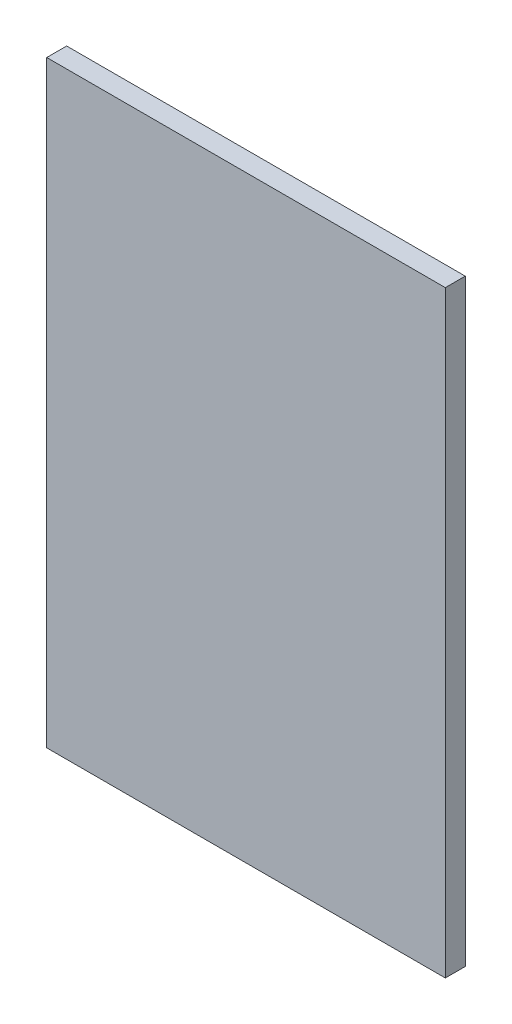
ISO-10303-21;
HEADER;
FILE_DESCRIPTION(('STEP AP214'),'2;1');
FILE_NAME('part.step','',(''),(''),'','','');
FILE_SCHEMA(('AUTOMOTIVE_DESIGN { 1 0 10303 214 1 1 1 1 }'));
ENDSEC;
DATA;
#1=APPLICATION_CONTEXT('core data for automotive mechanical design processes');
#2=APPLICATION_PROTOCOL_DEFINITION('international standard','automotive_design',2000,#1);
#3=PRODUCT_CONTEXT('',#1,'mechanical');
#4=PRODUCT('Part','Part','',(#3));
#5=PRODUCT_RELATED_PRODUCT_CATEGORY('part','',(#4));
#6=PRODUCT_DEFINITION_FORMATION('','',#4);
#7=PRODUCT_DEFINITION_CONTEXT('part definition',#1,'design');
#8=PRODUCT_DEFINITION('design','',#6,#7);
#9=PRODUCT_DEFINITION_SHAPE('','',#8);
#10=(LENGTH_UNIT() NAMED_UNIT(*) SI_UNIT(.MILLI.,.METRE.));
#11=(NAMED_UNIT(*) PLANE_ANGLE_UNIT() SI_UNIT($,.RADIAN.));
#12=(NAMED_UNIT(*) SI_UNIT($,.STERADIAN.) SOLID_ANGLE_UNIT());
#13=UNCERTAINTY_MEASURE_WITH_UNIT(LENGTH_MEASURE(1.E-05),#10,'distance_accuracy_value','');
#14=(GEOMETRIC_REPRESENTATION_CONTEXT(3) GLOBAL_UNCERTAINTY_ASSIGNED_CONTEXT((#13)) GLOBAL_UNIT_ASSIGNED_CONTEXT((#10,
#11,#12)) REPRESENTATION_CONTEXT('',''));
#15=CARTESIAN_POINT('',(0.,0.,0.));
#16=DIRECTION('',(0.,0.,1.));
#17=DIRECTION('',(1.,0.,0.));
#18=AXIS2_PLACEMENT_3D('',#15,#16,#17);
#19=CARTESIAN_POINT('',(0.,0.,10.));
#20=DIRECTION('',(1.,0.,0.));
#21=DIRECTION('',(0.,1.,0.));
#22=AXIS2_PLACEMENT_3D('',#19,#20,#21);
#23=PLANE('',#22);
#24=DIRECTION('',(0.,-1.,0.));
#25=VECTOR('',#24,1.);
#26=CARTESIAN_POINT('',(0.,0.,0.));
#27=LINE('',#26,#25);
#28=CARTESIAN_POINT('',(0.,300.,0.));
#29=VERTEX_POINT('',#28);
#30=CARTESIAN_POINT('',(0.,0.,0.));
#31=VERTEX_POINT('',#30);
#32=EDGE_CURVE('E97',#29,#31,#27,.T.);
#33=ORIENTED_EDGE('',*,*,#32,.T.);
#34=DIRECTION('',(0.,0.,-1.));
#35=VECTOR('',#34,1.);
#36=CARTESIAN_POINT('',(0.,0.,10.));
#37=LINE('',#36,#35);
#38=CARTESIAN_POINT('',(0.,0.,10.));
#39=VERTEX_POINT('',#38);
#40=EDGE_CURVE('E11',#39,#31,#37,.T.);
#41=ORIENTED_EDGE('',*,*,#40,.F.);
#42=DIRECTION('',(0.,-1.,0.));
#43=VECTOR('',#42,1.);
#44=CARTESIAN_POINT('',(0.,0.,10.));
#45=LINE('',#44,#43);
#46=CARTESIAN_POINT('',(0.,300.,10.));
#47=VERTEX_POINT('',#46);
#48=EDGE_CURVE('E85',#47,#39,#45,.T.);
#49=ORIENTED_EDGE('',*,*,#48,.F.);
#50=DIRECTION('',(0.,0.,-1.));
#51=VECTOR('',#50,1.);
#52=CARTESIAN_POINT('',(0.,300.,10.));
#53=LINE('',#52,#51);
#54=EDGE_CURVE('E93',#47,#29,#53,.T.);
#55=ORIENTED_EDGE('',*,*,#54,.T.);
#56=EDGE_LOOP('',(#33,#41,#49,#55));
#57=FACE_BOUND('',#56,.T.);
#58=ADVANCED_FACE('F34',(#57),#23,.F.);
#59=CARTESIAN_POINT('',(0.,0.,10.));
#60=DIRECTION('',(0.,1.,0.));
#61=DIRECTION('',(0.,0.,1.));
#62=AXIS2_PLACEMENT_3D('',#59,#60,#61);
#63=PLANE('',#62);
#64=DIRECTION('',(1.,0.,0.));
#65=VECTOR('',#64,1.);
#66=CARTESIAN_POINT('',(0.,0.,0.));
#67=LINE('',#66,#65);
#68=CARTESIAN_POINT('',(200.,0.,0.));
#69=VERTEX_POINT('',#68);
#70=EDGE_CURVE('E89',#31,#69,#67,.T.);
#71=ORIENTED_EDGE('',*,*,#70,.T.);
#72=DIRECTION('',(0.,0.,-1.));
#73=VECTOR('',#72,1.);
#74=CARTESIAN_POINT('',(200.,0.,10.));
#75=LINE('',#74,#73);
#76=CARTESIAN_POINT('',(200.,0.,10.));
#77=VERTEX_POINT('',#76);
#78=EDGE_CURVE('E42',#77,#69,#75,.T.);
#79=ORIENTED_EDGE('',*,*,#78,.F.);
#80=DIRECTION('',(1.,0.,0.));
#81=VECTOR('',#80,1.);
#82=CARTESIAN_POINT('',(0.,0.,10.));
#83=LINE('',#82,#81);
#84=EDGE_CURVE('E80',#39,#77,#83,.T.);
#85=ORIENTED_EDGE('',*,*,#84,.F.);
#86=ORIENTED_EDGE('',*,*,#40,.T.);
#87=EDGE_LOOP('',(#71,#79,#85,#86));
#88=FACE_BOUND('',#87,.T.);
#89=ADVANCED_FACE('F88',(#88),#63,.F.);
#90=CARTESIAN_POINT('',(200.,0.,10.));
#91=DIRECTION('',(-1.,0.,0.));
#92=DIRECTION('',(0.,-1.,0.));
#93=AXIS2_PLACEMENT_3D('',#90,#91,#92);
#94=PLANE('',#93);
#95=DIRECTION('',(0.,1.,0.));
#96=VECTOR('',#95,1.);
#97=CARTESIAN_POINT('',(200.,0.,0.));
#98=LINE('',#97,#96);
#99=CARTESIAN_POINT('',(200.,300.,0.));
#100=VERTEX_POINT('',#99);
#101=EDGE_CURVE('E67',#69,#100,#98,.T.);
#102=ORIENTED_EDGE('',*,*,#101,.T.);
#103=DIRECTION('',(0.,0.,-1.));
#104=VECTOR('',#103,1.);
#105=CARTESIAN_POINT('',(200.,300.,10.));
#106=LINE('',#105,#104);
#107=CARTESIAN_POINT('',(200.,300.,10.));
#108=VERTEX_POINT('',#107);
#109=EDGE_CURVE('E90',#108,#100,#106,.T.);
#110=ORIENTED_EDGE('',*,*,#109,.F.);
#111=DIRECTION('',(0.,1.,0.));
#112=VECTOR('',#111,1.);
#113=CARTESIAN_POINT('',(200.,0.,10.));
#114=LINE('',#113,#112);
#115=EDGE_CURVE('E83',#77,#108,#114,.T.);
#116=ORIENTED_EDGE('',*,*,#115,.F.);
#117=ORIENTED_EDGE('',*,*,#78,.T.);
#118=EDGE_LOOP('',(#102,#110,#116,#117));
#119=FACE_BOUND('',#118,.T.);
#120=ADVANCED_FACE('F91',(#119),#94,.F.);
#121=CARTESIAN_POINT('',(0.,300.,10.));
#122=DIRECTION('',(0.,-1.,0.));
#123=DIRECTION('',(0.,0.,-1.));
#124=AXIS2_PLACEMENT_3D('',#121,#122,#123);
#125=PLANE('',#124);
#126=DIRECTION('',(-1.,0.,0.));
#127=VECTOR('',#126,1.);
#128=CARTESIAN_POINT('',(0.,300.,0.));
#129=LINE('',#128,#127);
#130=EDGE_CURVE('E73',#100,#29,#129,.T.);
#131=ORIENTED_EDGE('',*,*,#130,.T.);
#132=ORIENTED_EDGE('',*,*,#54,.F.);
#133=DIRECTION('',(-1.,0.,0.));
#134=VECTOR('',#133,1.);
#135=CARTESIAN_POINT('',(0.,300.,10.));
#136=LINE('',#135,#134);
#137=EDGE_CURVE('E50',#108,#47,#136,.T.);
#138=ORIENTED_EDGE('',*,*,#137,.F.);
#139=ORIENTED_EDGE('',*,*,#109,.T.);
#140=EDGE_LOOP('',(#131,#132,#138,#139));
#141=FACE_BOUND('',#140,.T.);
#142=ADVANCED_FACE('F104',(#141),#125,.F.);
#143=CARTESIAN_POINT('',(0.,0.,10.));
#144=DIRECTION('',(0.,0.,-1.));
#145=DIRECTION('',(-1.,0.,0.));
#146=AXIS2_PLACEMENT_3D('',#143,#144,#145);
#147=PLANE('',#146);
#148=ORIENTED_EDGE('',*,*,#48,.T.);
#149=ORIENTED_EDGE('',*,*,#84,.T.);
#150=ORIENTED_EDGE('',*,*,#115,.T.);
#151=ORIENTED_EDGE('',*,*,#137,.T.);
#152=EDGE_LOOP('',(#148,#149,#150,#151));
#153=FACE_BOUND('',#152,.T.);
#154=ADVANCED_FACE('F81',(#153),#147,.F.);
#155=CARTESIAN_POINT('',(0.,0.,0.));
#156=DIRECTION('',(0.,0.,-1.));
#157=DIRECTION('',(-1.,0.,0.));
#158=AXIS2_PLACEMENT_3D('',#155,#156,#157);
#159=PLANE('',#158);
#160=ORIENTED_EDGE('',*,*,#32,.F.);
#161=ORIENTED_EDGE('',*,*,#130,.F.);
#162=ORIENTED_EDGE('',*,*,#101,.F.);
#163=ORIENTED_EDGE('',*,*,#70,.F.);
#164=EDGE_LOOP('',(#160,#161,#162,#163));
#165=FACE_BOUND('',#164,.T.);
#166=ADVANCED_FACE('F107',(#165),#159,.T.);
#167=CLOSED_SHELL('',(#58,#89,#120,#142,#154,#166));
#168=MANIFOLD_SOLID_BREP('B2',#167);
#169=ADVANCED_BREP_SHAPE_REPRESENTATION('',(#18,#168),#14);
#170=SHAPE_DEFINITION_REPRESENTATION(#9,#169);
ENDSEC;
END-ISO-10303-21;
